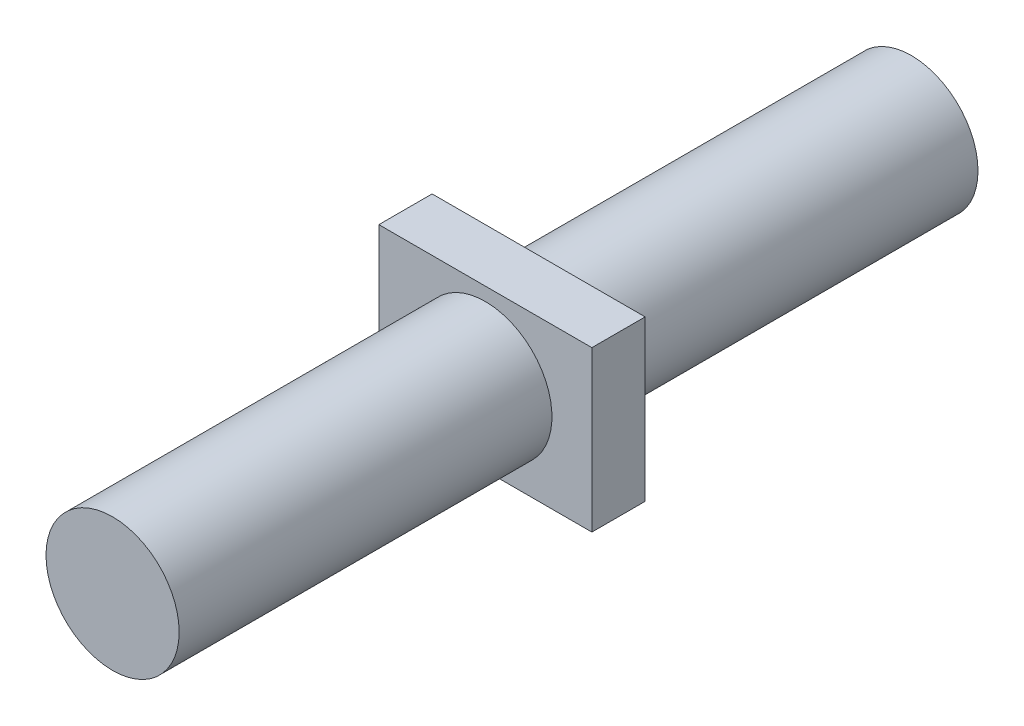
ISO-10303-21;
HEADER;
FILE_DESCRIPTION(('STEP AP214'),'2;1');
FILE_NAME('part.step','',(''),(''),'','','');
FILE_SCHEMA(('AUTOMOTIVE_DESIGN { 1 0 10303 214 1 1 1 1 }'));
ENDSEC;
DATA;
#1=APPLICATION_CONTEXT('core data for automotive mechanical design processes');
#2=APPLICATION_PROTOCOL_DEFINITION('international standard','automotive_design',2000,#1);
#3=PRODUCT_CONTEXT('',#1,'mechanical');
#4=PRODUCT('Part','Part','',(#3));
#5=PRODUCT_RELATED_PRODUCT_CATEGORY('part','',(#4));
#6=PRODUCT_DEFINITION_FORMATION('','',#4);
#7=PRODUCT_DEFINITION_CONTEXT('part definition',#1,'design');
#8=PRODUCT_DEFINITION('design','',#6,#7);
#9=PRODUCT_DEFINITION_SHAPE('','',#8);
#10=(LENGTH_UNIT() NAMED_UNIT(*) SI_UNIT(.MILLI.,.METRE.));
#11=(NAMED_UNIT(*) PLANE_ANGLE_UNIT() SI_UNIT($,.RADIAN.));
#12=(NAMED_UNIT(*) SI_UNIT($,.STERADIAN.) SOLID_ANGLE_UNIT());
#13=UNCERTAINTY_MEASURE_WITH_UNIT(LENGTH_MEASURE(1.E-05),#10,'distance_accuracy_value','');
#14=(GEOMETRIC_REPRESENTATION_CONTEXT(3) GLOBAL_UNCERTAINTY_ASSIGNED_CONTEXT((#13)) GLOBAL_UNIT_ASSIGNED_CONTEXT((#10,
#11,#12)) REPRESENTATION_CONTEXT('',''));
#15=CARTESIAN_POINT('',(0.,0.,0.));
#16=DIRECTION('',(0.,0.,1.));
#17=DIRECTION('',(1.,0.,0.));
#18=AXIS2_PLACEMENT_3D('',#15,#16,#17);
#19=CARTESIAN_POINT('',(0.,0.,150.));
#20=DIRECTION('',(0.,0.,-1.));
#21=DIRECTION('',(-1.,0.,0.));
#22=AXIS2_PLACEMENT_3D('',#19,#20,#21);
#23=CYLINDRICAL_SURFACE('',#22,12.5);
#24=CARTESIAN_POINT('',(0.,0.,70.));
#25=DIRECTION('',(0.,0.,-1.));
#26=DIRECTION('',(-1.,0.,0.));
#27=AXIS2_PLACEMENT_3D('',#24,#25,#26);
#28=CIRCLE('',#27,12.5);
#29=CARTESIAN_POINT('',(-12.5,0.,70.));
#30=VERTEX_POINT('',#29);
#31=EDGE_CURVE('E42',#30,#30,#28,.T.);
#32=ORIENTED_EDGE('',*,*,#31,.T.);
#33=EDGE_LOOP('',(#32));
#34=FACE_BOUND('',#33,.T.);
#35=CARTESIAN_POINT('',(0.,0.,0.));
#36=DIRECTION('',(0.,0.,1.));
#37=DIRECTION('',(1.,0.,0.));
#38=AXIS2_PLACEMENT_3D('',#35,#36,#37);
#39=CIRCLE('',#38,12.5);
#40=CARTESIAN_POINT('',(12.5,0.,0.));
#41=VERTEX_POINT('',#40);
#42=EDGE_CURVE('E131',#41,#41,#39,.T.);
#43=ORIENTED_EDGE('',*,*,#42,.T.);
#44=EDGE_LOOP('',(#43));
#45=FACE_BOUND('',#44,.T.);
#46=ADVANCED_FACE('F39',(#34,#45),#23,.T.);
#47=CARTESIAN_POINT('',(0.,0.,0.));
#48=DIRECTION('',(0.,0.,1.));
#49=DIRECTION('',(1.,0.,0.));
#50=AXIS2_PLACEMENT_3D('',#47,#48,#49);
#51=PLANE('',#50);
#52=ORIENTED_EDGE('',*,*,#42,.F.);
#53=EDGE_LOOP('',(#52));
#54=FACE_BOUND('',#53,.T.);
#55=ADVANCED_FACE('F157',(#54),#51,.F.);
#56=CARTESIAN_POINT('',(20.,-15.,70.));
#57=DIRECTION('',(1.,0.,0.));
#58=DIRECTION('',(0.,0.,-1.));
#59=AXIS2_PLACEMENT_3D('',#56,#57,#58);
#60=PLANE('',#59);
#61=DIRECTION('',(0.,0.,1.));
#62=VECTOR('',#61,1.);
#63=CARTESIAN_POINT('',(20.,15.,70.));
#64=LINE('',#63,#62);
#65=CARTESIAN_POINT('',(20.,15.,70.));
#66=VERTEX_POINT('',#65);
#67=CARTESIAN_POINT('',(20.,15.,80.));
#68=VERTEX_POINT('',#67);
#69=EDGE_CURVE('E80',#66,#68,#64,.T.);
#70=ORIENTED_EDGE('',*,*,#69,.T.);
#71=DIRECTION('',(0.,1.,0.));
#72=VECTOR('',#71,1.);
#73=CARTESIAN_POINT('',(20.,-15.,80.));
#74=LINE('',#73,#72);
#75=CARTESIAN_POINT('',(20.,-15.,80.));
#76=VERTEX_POINT('',#75);
#77=EDGE_CURVE('E84',#76,#68,#74,.T.);
#78=ORIENTED_EDGE('',*,*,#77,.F.);
#79=DIRECTION('',(0.,0.,1.));
#80=VECTOR('',#79,1.);
#81=CARTESIAN_POINT('',(20.,-15.,70.));
#82=LINE('',#81,#80);
#83=CARTESIAN_POINT('',(20.,-15.,70.));
#84=VERTEX_POINT('',#83);
#85=EDGE_CURVE('E55',#84,#76,#82,.T.);
#86=ORIENTED_EDGE('',*,*,#85,.F.);
#87=DIRECTION('',(0.,1.,0.));
#88=VECTOR('',#87,1.);
#89=CARTESIAN_POINT('',(20.,-15.,70.));
#90=LINE('',#89,#88);
#91=EDGE_CURVE('E85',#84,#66,#90,.T.);
#92=ORIENTED_EDGE('',*,*,#91,.T.);
#93=EDGE_LOOP('',(#70,#78,#86,#92));
#94=FACE_BOUND('',#93,.T.);
#95=ADVANCED_FACE('F82',(#94),#60,.T.);
#96=CARTESIAN_POINT('',(-20.,-15.,70.));
#97=DIRECTION('',(0.,-1.,0.));
#98=DIRECTION('',(0.,0.,-1.));
#99=AXIS2_PLACEMENT_3D('',#96,#97,#98);
#100=PLANE('',#99);
#101=ORIENTED_EDGE('',*,*,#85,.T.);
#102=DIRECTION('',(1.,0.,0.));
#103=VECTOR('',#102,1.);
#104=CARTESIAN_POINT('',(-20.,-15.,80.));
#105=LINE('',#104,#103);
#106=CARTESIAN_POINT('',(-20.,-15.,80.));
#107=VERTEX_POINT('',#106);
#108=EDGE_CURVE('E104',#107,#76,#105,.T.);
#109=ORIENTED_EDGE('',*,*,#108,.F.);
#110=DIRECTION('',(0.,0.,1.));
#111=VECTOR('',#110,1.);
#112=CARTESIAN_POINT('',(-20.,-15.,70.));
#113=LINE('',#112,#111);
#114=CARTESIAN_POINT('',(-20.,-15.,70.));
#115=VERTEX_POINT('',#114);
#116=EDGE_CURVE('E63',#115,#107,#113,.T.);
#117=ORIENTED_EDGE('',*,*,#116,.F.);
#118=DIRECTION('',(1.,0.,0.));
#119=VECTOR('',#118,1.);
#120=CARTESIAN_POINT('',(-20.,-15.,70.));
#121=LINE('',#120,#119);
#122=EDGE_CURVE('E91',#115,#84,#121,.T.);
#123=ORIENTED_EDGE('',*,*,#122,.T.);
#124=EDGE_LOOP('',(#101,#109,#117,#123));
#125=FACE_BOUND('',#124,.T.);
#126=ADVANCED_FACE('F147',(#125),#100,.T.);
#127=CARTESIAN_POINT('',(-20.,-15.,70.));
#128=DIRECTION('',(-1.,0.,0.));
#129=DIRECTION('',(0.,0.,1.));
#130=AXIS2_PLACEMENT_3D('',#127,#128,#129);
#131=PLANE('',#130);
#132=ORIENTED_EDGE('',*,*,#116,.T.);
#133=DIRECTION('',(0.,-1.,0.));
#134=VECTOR('',#133,1.);
#135=CARTESIAN_POINT('',(-20.,-15.,80.));
#136=LINE('',#135,#134);
#137=CARTESIAN_POINT('',(-20.,15.,80.));
#138=VERTEX_POINT('',#137);
#139=EDGE_CURVE('E100',#138,#107,#136,.T.);
#140=ORIENTED_EDGE('',*,*,#139,.F.);
#141=DIRECTION('',(0.,0.,1.));
#142=VECTOR('',#141,1.);
#143=CARTESIAN_POINT('',(-20.,15.,70.));
#144=LINE('',#143,#142);
#145=CARTESIAN_POINT('',(-20.,15.,70.));
#146=VERTEX_POINT('',#145);
#147=EDGE_CURVE('E90',#146,#138,#144,.T.);
#148=ORIENTED_EDGE('',*,*,#147,.F.);
#149=DIRECTION('',(0.,-1.,0.));
#150=VECTOR('',#149,1.);
#151=CARTESIAN_POINT('',(-20.,-15.,70.));
#152=LINE('',#151,#150);
#153=EDGE_CURVE('E117',#146,#115,#152,.T.);
#154=ORIENTED_EDGE('',*,*,#153,.T.);
#155=EDGE_LOOP('',(#132,#140,#148,#154));
#156=FACE_BOUND('',#155,.T.);
#157=ADVANCED_FACE('F149',(#156),#131,.T.);
#158=CARTESIAN_POINT('',(-20.,15.,70.));
#159=DIRECTION('',(0.,1.,0.));
#160=DIRECTION('',(0.,0.,1.));
#161=AXIS2_PLACEMENT_3D('',#158,#159,#160);
#162=PLANE('',#161);
#163=ORIENTED_EDGE('',*,*,#147,.T.);
#164=DIRECTION('',(-1.,0.,0.));
#165=VECTOR('',#164,1.);
#166=CARTESIAN_POINT('',(-20.,15.,80.));
#167=LINE('',#166,#165);
#168=EDGE_CURVE('E94',#68,#138,#167,.T.);
#169=ORIENTED_EDGE('',*,*,#168,.F.);
#170=ORIENTED_EDGE('',*,*,#69,.F.);
#171=DIRECTION('',(-1.,0.,0.));
#172=VECTOR('',#171,1.);
#173=CARTESIAN_POINT('',(-20.,15.,70.));
#174=LINE('',#173,#172);
#175=EDGE_CURVE('E114',#66,#146,#174,.T.);
#176=ORIENTED_EDGE('',*,*,#175,.T.);
#177=EDGE_LOOP('',(#163,#169,#170,#176));
#178=FACE_BOUND('',#177,.T.);
#179=ADVANCED_FACE('F95',(#178),#162,.T.);
#180=CARTESIAN_POINT('',(0.,0.,70.));
#181=DIRECTION('',(0.,0.,-1.));
#182=DIRECTION('',(-1.,0.,0.));
#183=AXIS2_PLACEMENT_3D('',#180,#181,#182);
#184=PLANE('',#183);
#185=ORIENTED_EDGE('',*,*,#31,.F.);
#186=EDGE_LOOP('',(#185));
#187=FACE_BOUND('',#186,.T.);
#188=ORIENTED_EDGE('',*,*,#91,.F.);
#189=ORIENTED_EDGE('',*,*,#122,.F.);
#190=ORIENTED_EDGE('',*,*,#153,.F.);
#191=ORIENTED_EDGE('',*,*,#175,.F.);
#192=EDGE_LOOP('',(#188,#189,#190,#191));
#193=FACE_BOUND('',#192,.T.);
#194=ADVANCED_FACE('F141',(#187,#193),#184,.T.);
#195=CARTESIAN_POINT('',(0.,0.,80.));
#196=DIRECTION('',(0.,0.,-1.));
#197=DIRECTION('',(-1.,0.,0.));
#198=AXIS2_PLACEMENT_3D('',#195,#196,#197);
#199=PLANE('',#198);
#200=CARTESIAN_POINT('',(0.,0.,80.));
#201=DIRECTION('',(0.,0.,-1.));
#202=DIRECTION('',(-1.,0.,0.));
#203=AXIS2_PLACEMENT_3D('',#200,#201,#202);
#204=CIRCLE('',#203,12.5);
#205=CARTESIAN_POINT('',(-12.5,0.,80.));
#206=VERTEX_POINT('',#205);
#207=EDGE_CURVE('E11',#206,#206,#204,.T.);
#208=ORIENTED_EDGE('',*,*,#207,.T.);
#209=EDGE_LOOP('',(#208));
#210=FACE_BOUND('',#209,.T.);
#211=ORIENTED_EDGE('',*,*,#77,.T.);
#212=ORIENTED_EDGE('',*,*,#168,.T.);
#213=ORIENTED_EDGE('',*,*,#139,.T.);
#214=ORIENTED_EDGE('',*,*,#108,.T.);
#215=EDGE_LOOP('',(#211,#212,#213,#214));
#216=FACE_BOUND('',#215,.T.);
#217=ADVANCED_FACE('F103',(#210,#216),#199,.F.);
#218=CARTESIAN_POINT('',(0.,0.,150.));
#219=DIRECTION('',(0.,0.,1.));
#220=DIRECTION('',(1.,0.,0.));
#221=AXIS2_PLACEMENT_3D('',#218,#219,#220);
#222=PLANE('',#221);
#223=CARTESIAN_POINT('',(0.,0.,150.));
#224=DIRECTION('',(0.,0.,1.));
#225=DIRECTION('',(1.,0.,0.));
#226=AXIS2_PLACEMENT_3D('',#223,#224,#225);
#227=CIRCLE('',#226,12.5);
#228=CARTESIAN_POINT('',(12.5,0.,150.));
#229=VERTEX_POINT('',#228);
#230=EDGE_CURVE('E48',#229,#229,#227,.T.);
#231=ORIENTED_EDGE('',*,*,#230,.T.);
#232=EDGE_LOOP('',(#231));
#233=FACE_BOUND('',#232,.T.);
#234=ADVANCED_FACE('F166',(#233),#222,.T.);
#235=ORIENTED_EDGE('',*,*,#230,.F.);
#236=EDGE_LOOP('',(#235));
#237=FACE_BOUND('',#236,.T.);
#238=ORIENTED_EDGE('',*,*,#207,.F.);
#239=EDGE_LOOP('',(#238));
#240=FACE_BOUND('',#239,.T.);
#241=ADVANCED_FACE('F160',(#237,#240),#23,.T.);
#242=CLOSED_SHELL('',(#46,#55,#95,#126,#157,#179,#194,#217,#234,#241));
#243=MANIFOLD_SOLID_BREP('B2',#242);
#244=ADVANCED_BREP_SHAPE_REPRESENTATION('',(#18,#243),#14);
#245=SHAPE_DEFINITION_REPRESENTATION(#9,#244);
ENDSEC;
END-ISO-10303-21;
